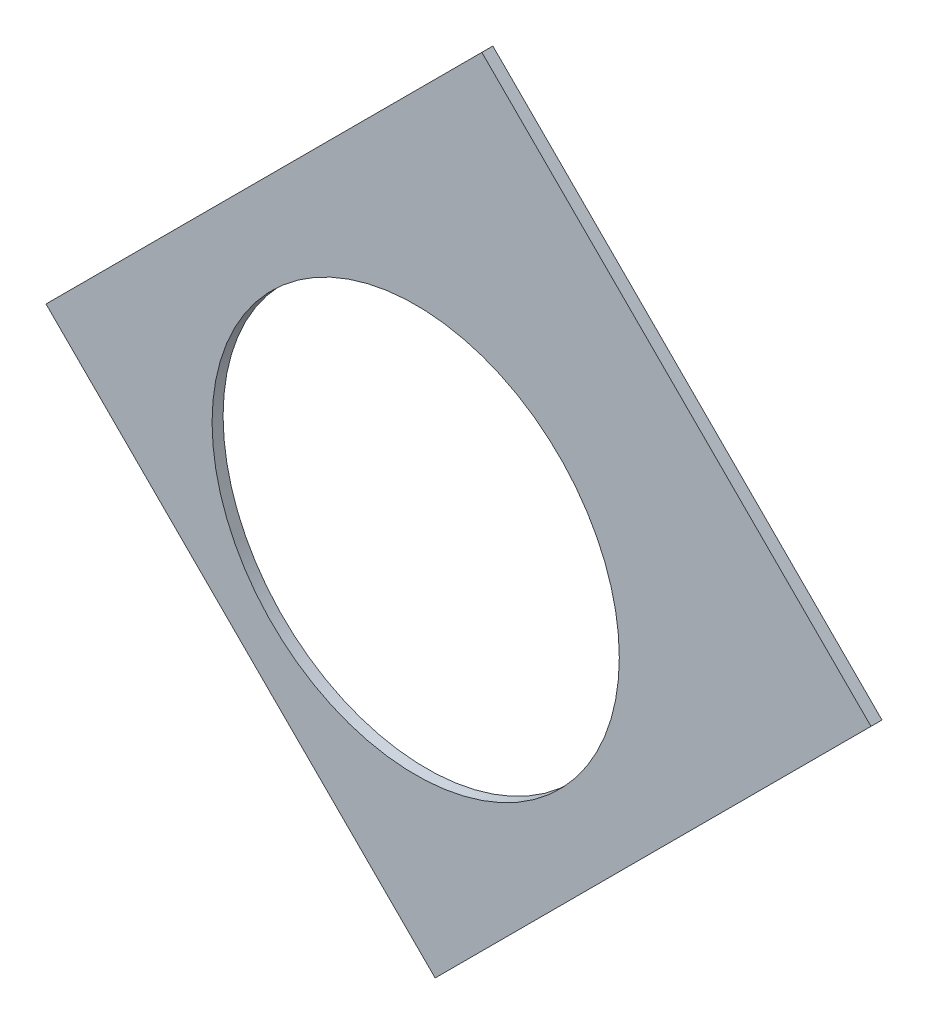
ISO-10303-21;
HEADER;
FILE_DESCRIPTION(('STEP AP214'),'2;1');
FILE_NAME('part.step','',(''),(''),'','','');
FILE_SCHEMA(('AUTOMOTIVE_DESIGN { 1 0 10303 214 1 1 1 1 }'));
ENDSEC;
DATA;
#1=APPLICATION_CONTEXT('core data for automotive mechanical design processes');
#2=APPLICATION_PROTOCOL_DEFINITION('international standard','automotive_design',2000,#1);
#3=PRODUCT_CONTEXT('',#1,'mechanical');
#4=PRODUCT('Part','Part','',(#3));
#5=PRODUCT_RELATED_PRODUCT_CATEGORY('part','',(#4));
#6=PRODUCT_DEFINITION_FORMATION('','',#4);
#7=PRODUCT_DEFINITION_CONTEXT('part definition',#1,'design');
#8=PRODUCT_DEFINITION('design','',#6,#7);
#9=PRODUCT_DEFINITION_SHAPE('','',#8);
#10=(LENGTH_UNIT() NAMED_UNIT(*) SI_UNIT(.MILLI.,.METRE.));
#11=(NAMED_UNIT(*) PLANE_ANGLE_UNIT() SI_UNIT($,.RADIAN.));
#12=(NAMED_UNIT(*) SI_UNIT($,.STERADIAN.) SOLID_ANGLE_UNIT());
#13=UNCERTAINTY_MEASURE_WITH_UNIT(LENGTH_MEASURE(1.E-05),#10,'distance_accuracy_value','');
#14=(GEOMETRIC_REPRESENTATION_CONTEXT(3) GLOBAL_UNCERTAINTY_ASSIGNED_CONTEXT((#13)) GLOBAL_UNIT_ASSIGNED_CONTEXT((#10,
#11,#12)) REPRESENTATION_CONTEXT('',''));
#15=CARTESIAN_POINT('',(0.,0.,0.));
#16=DIRECTION('',(0.,0.,1.));
#17=DIRECTION('',(1.,0.,0.));
#18=AXIS2_PLACEMENT_3D('',#15,#16,#17);
#19=CARTESIAN_POINT('',(0.,0.,0.254));
#20=DIRECTION('',(0.,0.,-1.));
#21=DIRECTION('',(-1.,0.,0.));
#22=AXIS2_PLACEMENT_3D('',#19,#20,#21);
#23=PLANE('',#22);
#24=CARTESIAN_POINT('',(53.5223264815721,53.5223264815723,0.254));
#25=DIRECTION('',(0.,0.,1.));
#26=DIRECTION('',(1.,0.,0.));
#27=AXIS2_PLACEMENT_3D('',#24,#25,#26);
#28=CIRCLE('',#27,4.699);
#29=CARTESIAN_POINT('',(58.2213264815721,53.5223264815723,0.254));
#30=VERTEX_POINT('',#29);
#31=EDGE_CURVE('E99',#30,#30,#28,.T.);
#32=ORIENTED_EDGE('',*,*,#31,.F.);
#33=EDGE_LOOP('',(#32));
#34=FACE_BOUND('',#33,.T.);
#35=DIRECTION('',(-0.707106781186553,0.707106781186542,0.));
#36=VECTOR('',#35,1.);
#37=CARTESIAN_POINT('',(44.9910831665563,53.9713392876257,0.254));
#38=LINE('',#37,#36);
#39=CARTESIAN_POINT('',(53.9713392876255,44.9910831665566,0.254));
#40=VERTEX_POINT('',#39);
#41=CARTESIAN_POINT('',(44.9910831665563,53.9713392876257,0.254));
#42=VERTEX_POINT('',#41);
#43=EDGE_CURVE('E81',#40,#42,#38,.T.);
#44=ORIENTED_EDGE('',*,*,#43,.F.);
#45=DIRECTION('',(-0.707106781186546,-0.707106781186549,0.));
#46=VECTOR('',#45,1.);
#47=CARTESIAN_POINT('',(67.191354125102,58.2110980040331,0.254));
#48=LINE('',#47,#46);
#49=CARTESIAN_POINT('',(64.0292261432229,55.048970022154,0.254));
#50=VERTEX_POINT('',#49);
#51=EDGE_CURVE('E89',#50,#40,#48,.T.);
#52=ORIENTED_EDGE('',*,*,#51,.F.);
#53=DIRECTION('',(0.707106781186548,-0.707106781186548,0.));
#54=VECTOR('',#53,1.);
#55=CARTESIAN_POINT('',(55.0489700221538,64.0292261432232,0.254));
#56=LINE('',#55,#54);
#57=CARTESIAN_POINT('',(55.0489700221538,64.0292261432232,0.254));
#58=VERTEX_POINT('',#57);
#59=EDGE_CURVE('E108',#58,#50,#56,.T.);
#60=ORIENTED_EDGE('',*,*,#59,.F.);
#61=DIRECTION('',(-0.707106781186546,-0.707106781186549,0.));
#62=VECTOR('',#61,1.);
#63=CARTESIAN_POINT('',(67.2114671100052,76.1917232310746,0.254));
#64=LINE('',#63,#62);
#65=EDGE_CURVE('E12',#58,#42,#64,.T.);
#66=ORIENTED_EDGE('',*,*,#65,.T.);
#67=EDGE_LOOP('',(#44,#52,#60,#66));
#68=FACE_BOUND('',#67,.T.);
#69=ADVANCED_FACE('F35',(#34,#68),#23,.F.);
#70=CARTESIAN_POINT('',(0.,0.,0.));
#71=DIRECTION('',(0.,0.,-1.));
#72=DIRECTION('',(-1.,0.,0.));
#73=AXIS2_PLACEMENT_3D('',#70,#71,#72);
#74=PLANE('',#73);
#75=CARTESIAN_POINT('',(53.5223264815721,53.5223264815723,0.));
#76=DIRECTION('',(0.,0.,1.));
#77=DIRECTION('',(1.,0.,0.));
#78=AXIS2_PLACEMENT_3D('',#75,#76,#77);
#79=CIRCLE('',#78,4.699);
#80=CARTESIAN_POINT('',(58.2213264815721,53.5223264815723,0.));
#81=VERTEX_POINT('',#80);
#82=EDGE_CURVE('E95',#81,#81,#79,.T.);
#83=ORIENTED_EDGE('',*,*,#82,.T.);
#84=EDGE_LOOP('',(#83));
#85=FACE_BOUND('',#84,.T.);
#86=DIRECTION('',(-0.707106781186546,-0.707106781186549,0.));
#87=VECTOR('',#86,1.);
#88=CARTESIAN_POINT('',(67.191354125102,58.2110980040331,0.));
#89=LINE('',#88,#87);
#90=CARTESIAN_POINT('',(64.0292261432229,55.048970022154,0.));
#91=VERTEX_POINT('',#90);
#92=CARTESIAN_POINT('',(53.9713392876255,44.9910831665566,0.));
#93=VERTEX_POINT('',#92);
#94=EDGE_CURVE('E87',#91,#93,#89,.T.);
#95=ORIENTED_EDGE('',*,*,#94,.T.);
#96=DIRECTION('',(-0.707106781186553,0.707106781186542,0.));
#97=VECTOR('',#96,1.);
#98=CARTESIAN_POINT('',(44.9910831665563,53.9713392876257,0.));
#99=LINE('',#98,#97);
#100=CARTESIAN_POINT('',(44.9910831665563,53.9713392876257,0.));
#101=VERTEX_POINT('',#100);
#102=EDGE_CURVE('E72',#93,#101,#99,.T.);
#103=ORIENTED_EDGE('',*,*,#102,.T.);
#104=DIRECTION('',(-0.707106781186546,-0.707106781186549,0.));
#105=VECTOR('',#104,1.);
#106=CARTESIAN_POINT('',(67.2114671100052,76.1917232310746,0.));
#107=LINE('',#106,#105);
#108=CARTESIAN_POINT('',(55.0489700221538,64.0292261432232,0.));
#109=VERTEX_POINT('',#108);
#110=EDGE_CURVE('E39',#109,#101,#107,.T.);
#111=ORIENTED_EDGE('',*,*,#110,.F.);
#112=DIRECTION('',(0.707106781186548,-0.707106781186548,0.));
#113=VECTOR('',#112,1.);
#114=CARTESIAN_POINT('',(55.0489700221538,64.0292261432232,0.));
#115=LINE('',#114,#113);
#116=EDGE_CURVE('E93',#109,#91,#115,.T.);
#117=ORIENTED_EDGE('',*,*,#116,.T.);
#118=EDGE_LOOP('',(#95,#103,#111,#117));
#119=FACE_BOUND('',#118,.T.);
#120=ADVANCED_FACE('F92',(#85,#119),#74,.T.);
#121=CARTESIAN_POINT('',(67.191354125102,58.2110980040331,0.254));
#122=DIRECTION('',(0.707106781186549,-0.707106781186546,0.));
#123=DIRECTION('',(0.707106781186546,0.707106781186549,0.));
#124=AXIS2_PLACEMENT_3D('',#121,#122,#123);
#125=PLANE('',#124);
#126=ORIENTED_EDGE('',*,*,#51,.T.);
#127=DIRECTION('',(0.,0.,1.));
#128=VECTOR('',#127,1.);
#129=CARTESIAN_POINT('',(53.9713392876255,44.9910831665566,0.));
#130=LINE('',#129,#128);
#131=EDGE_CURVE('E76',#93,#40,#130,.T.);
#132=ORIENTED_EDGE('',*,*,#131,.F.);
#133=ORIENTED_EDGE('',*,*,#94,.F.);
#134=DIRECTION('',(0.,0.,1.));
#135=VECTOR('',#134,1.);
#136=CARTESIAN_POINT('',(64.0292261432229,55.048970022154,0.));
#137=LINE('',#136,#135);
#138=EDGE_CURVE('E90',#91,#50,#137,.T.);
#139=ORIENTED_EDGE('',*,*,#138,.T.);
#140=EDGE_LOOP('',(#126,#132,#133,#139));
#141=FACE_BOUND('',#140,.T.);
#142=ADVANCED_FACE('F85',(#141),#125,.T.);
#143=CARTESIAN_POINT('',(67.2114671100052,76.1917232310746,0.254));
#144=DIRECTION('',(0.707106781186549,-0.707106781186546,0.));
#145=DIRECTION('',(0.707106781186546,0.707106781186549,0.));
#146=AXIS2_PLACEMENT_3D('',#143,#144,#145);
#147=PLANE('',#146);
#148=ORIENTED_EDGE('',*,*,#65,.F.);
#149=DIRECTION('',(0.,0.,1.));
#150=VECTOR('',#149,1.);
#151=CARTESIAN_POINT('',(55.0489700221538,64.0292261432232,0.));
#152=LINE('',#151,#150);
#153=EDGE_CURVE('E105',#109,#58,#152,.T.);
#154=ORIENTED_EDGE('',*,*,#153,.F.);
#155=ORIENTED_EDGE('',*,*,#110,.T.);
#156=DIRECTION('',(0.,0.,1.));
#157=VECTOR('',#156,1.);
#158=CARTESIAN_POINT('',(44.9910831665563,53.9713392876257,0.));
#159=LINE('',#158,#157);
#160=EDGE_CURVE('E78',#101,#42,#159,.T.);
#161=ORIENTED_EDGE('',*,*,#160,.T.);
#162=EDGE_LOOP('',(#148,#154,#155,#161));
#163=FACE_BOUND('',#162,.T.);
#164=ADVANCED_FACE('F37',(#163),#147,.F.);
#165=CARTESIAN_POINT('',(53.5223264815721,53.5223264815723,0.));
#166=DIRECTION('',(0.,0.,1.));
#167=DIRECTION('',(1.,0.,0.));
#168=AXIS2_PLACEMENT_3D('',#165,#166,#167);
#169=CYLINDRICAL_SURFACE('',#168,4.699);
#170=ORIENTED_EDGE('',*,*,#82,.F.);
#171=EDGE_LOOP('',(#170));
#172=FACE_BOUND('',#171,.T.);
#173=ORIENTED_EDGE('',*,*,#31,.T.);
#174=EDGE_LOOP('',(#173));
#175=FACE_BOUND('',#174,.T.);
#176=ADVANCED_FACE('F121',(#172,#175),#169,.F.);
#177=CARTESIAN_POINT('',(44.9910831665563,53.9713392876257,0.));
#178=DIRECTION('',(0.707106781186542,0.707106781186553,0.));
#179=DIRECTION('',(-0.707106781186553,0.707106781186542,0.));
#180=AXIS2_PLACEMENT_3D('',#177,#178,#179);
#181=PLANE('',#180);
#182=ORIENTED_EDGE('',*,*,#43,.T.);
#183=ORIENTED_EDGE('',*,*,#160,.F.);
#184=ORIENTED_EDGE('',*,*,#102,.F.);
#185=ORIENTED_EDGE('',*,*,#131,.T.);
#186=EDGE_LOOP('',(#182,#183,#184,#185));
#187=FACE_BOUND('',#186,.T.);
#188=ADVANCED_FACE('F75',(#187),#181,.F.);
#189=CARTESIAN_POINT('',(55.0489700221538,64.0292261432232,0.));
#190=DIRECTION('',(-0.707106781186548,-0.707106781186548,0.));
#191=DIRECTION('',(0.707106781186548,-0.707106781186548,0.));
#192=AXIS2_PLACEMENT_3D('',#189,#190,#191);
#193=PLANE('',#192);
#194=ORIENTED_EDGE('',*,*,#59,.T.);
#195=ORIENTED_EDGE('',*,*,#138,.F.);
#196=ORIENTED_EDGE('',*,*,#116,.F.);
#197=ORIENTED_EDGE('',*,*,#153,.T.);
#198=EDGE_LOOP('',(#194,#195,#196,#197));
#199=FACE_BOUND('',#198,.T.);
#200=ADVANCED_FACE('F115',(#199),#193,.F.);
#201=CLOSED_SHELL('',(#69,#120,#142,#164,#176,#188,#200));
#202=MANIFOLD_SOLID_BREP('B2',#201);
#203=ADVANCED_BREP_SHAPE_REPRESENTATION('',(#18,#202),#14);
#204=SHAPE_DEFINITION_REPRESENTATION(#9,#203);
ENDSEC;
END-ISO-10303-21;
